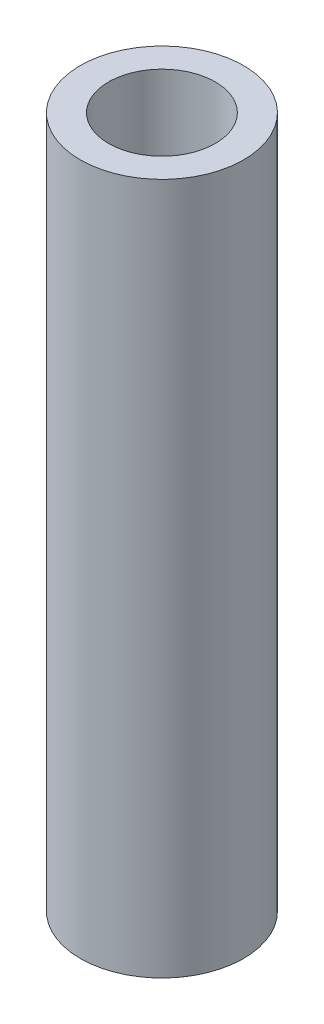
ISO-10303-21;
HEADER;
FILE_DESCRIPTION(('STEP AP214'),'2;1');
FILE_NAME('part.step','',(''),(''),'','','');
FILE_SCHEMA(('AUTOMOTIVE_DESIGN { 1 0 10303 214 1 1 1 1 }'));
ENDSEC;
DATA;
#1=APPLICATION_CONTEXT('core data for automotive mechanical design processes');
#2=APPLICATION_PROTOCOL_DEFINITION('international standard','automotive_design',2000,#1);
#3=PRODUCT_CONTEXT('',#1,'mechanical');
#4=PRODUCT('Part','Part','',(#3));
#5=PRODUCT_RELATED_PRODUCT_CATEGORY('part','',(#4));
#6=PRODUCT_DEFINITION_FORMATION('','',#4);
#7=PRODUCT_DEFINITION_CONTEXT('part definition',#1,'design');
#8=PRODUCT_DEFINITION('design','',#6,#7);
#9=PRODUCT_DEFINITION_SHAPE('','',#8);
#10=(LENGTH_UNIT() NAMED_UNIT(*) SI_UNIT(.MILLI.,.METRE.));
#11=(NAMED_UNIT(*) PLANE_ANGLE_UNIT() SI_UNIT($,.RADIAN.));
#12=(NAMED_UNIT(*) SI_UNIT($,.STERADIAN.) SOLID_ANGLE_UNIT());
#13=UNCERTAINTY_MEASURE_WITH_UNIT(LENGTH_MEASURE(1.E-05),#10,'distance_accuracy_value','');
#14=(GEOMETRIC_REPRESENTATION_CONTEXT(3) GLOBAL_UNCERTAINTY_ASSIGNED_CONTEXT((#13)) GLOBAL_UNIT_ASSIGNED_CONTEXT((#10,
#11,#12)) REPRESENTATION_CONTEXT('',''));
#15=CARTESIAN_POINT('',(0.,0.,0.));
#16=DIRECTION('',(0.,0.,1.));
#17=DIRECTION('',(1.,0.,0.));
#18=AXIS2_PLACEMENT_3D('',#15,#16,#17);
#19=CARTESIAN_POINT('',(0.,32.258,0.));
#20=DIRECTION('',(0.,1.,0.));
#21=DIRECTION('',(0.,0.,1.));
#22=AXIS2_PLACEMENT_3D('',#19,#20,#21);
#23=PLANE('',#22);
#24=CARTESIAN_POINT('',(0.,32.258,0.));
#25=DIRECTION('',(0.,1.,0.));
#26=DIRECTION('',(0.,0.,1.));
#27=AXIS2_PLACEMENT_3D('',#24,#25,#26);
#28=CIRCLE('',#27,3.81);
#29=CARTESIAN_POINT('',(0.,32.258,3.81));
#30=VERTEX_POINT('',#29);
#31=EDGE_CURVE('E10',#30,#30,#28,.T.);
#32=ORIENTED_EDGE('',*,*,#31,.T.);
#33=EDGE_LOOP('',(#32));
#34=FACE_BOUND('',#33,.T.);
#35=CARTESIAN_POINT('',(0.,32.258,0.));
#36=DIRECTION('',(0.,1.,0.));
#37=DIRECTION('',(0.,0.,1.));
#38=AXIS2_PLACEMENT_3D('',#35,#36,#37);
#39=CIRCLE('',#38,2.4892);
#40=CARTESIAN_POINT('',(0.,32.258,2.4892));
#41=VERTEX_POINT('',#40);
#42=EDGE_CURVE('E41',#41,#41,#39,.T.);
#43=ORIENTED_EDGE('',*,*,#42,.F.);
#44=EDGE_LOOP('',(#43));
#45=FACE_BOUND('',#44,.T.);
#46=ADVANCED_FACE('F30',(#34,#45),#23,.T.);
#47=CARTESIAN_POINT('',(0.,0.,0.));
#48=DIRECTION('',(0.,1.,0.));
#49=DIRECTION('',(0.,0.,1.));
#50=AXIS2_PLACEMENT_3D('',#47,#48,#49);
#51=PLANE('',#50);
#52=CARTESIAN_POINT('',(0.,0.,0.));
#53=DIRECTION('',(0.,1.,0.));
#54=DIRECTION('',(0.,0.,1.));
#55=AXIS2_PLACEMENT_3D('',#52,#53,#54);
#56=CIRCLE('',#55,3.81);
#57=CARTESIAN_POINT('',(0.,0.,3.81));
#58=VERTEX_POINT('',#57);
#59=EDGE_CURVE('E34',#58,#58,#56,.T.);
#60=ORIENTED_EDGE('',*,*,#59,.F.);
#61=EDGE_LOOP('',(#60));
#62=FACE_BOUND('',#61,.T.);
#63=CARTESIAN_POINT('',(0.,0.,0.));
#64=DIRECTION('',(0.,1.,0.));
#65=DIRECTION('',(0.,0.,1.));
#66=AXIS2_PLACEMENT_3D('',#63,#64,#65);
#67=CIRCLE('',#66,2.4892);
#68=CARTESIAN_POINT('',(0.,0.,2.4892));
#69=VERTEX_POINT('',#68);
#70=EDGE_CURVE('E43',#69,#69,#67,.T.);
#71=ORIENTED_EDGE('',*,*,#70,.T.);
#72=EDGE_LOOP('',(#71));
#73=FACE_BOUND('',#72,.T.);
#74=ADVANCED_FACE('F53',(#62,#73),#51,.F.);
#75=CARTESIAN_POINT('',(0.,32.258,0.));
#76=DIRECTION('',(0.,-1.,0.));
#77=DIRECTION('',(0.,0.,-1.));
#78=AXIS2_PLACEMENT_3D('',#75,#76,#77);
#79=CYLINDRICAL_SURFACE('',#78,3.81);
#80=ORIENTED_EDGE('',*,*,#31,.F.);
#81=EDGE_LOOP('',(#80));
#82=FACE_BOUND('',#81,.T.);
#83=ORIENTED_EDGE('',*,*,#59,.T.);
#84=EDGE_LOOP('',(#83));
#85=FACE_BOUND('',#84,.T.);
#86=ADVANCED_FACE('F32',(#82,#85),#79,.T.);
#87=CARTESIAN_POINT('',(0.,32.258,0.));
#88=DIRECTION('',(0.,-1.,0.));
#89=DIRECTION('',(0.,0.,-1.));
#90=AXIS2_PLACEMENT_3D('',#87,#88,#89);
#91=CYLINDRICAL_SURFACE('',#90,2.4892);
#92=ORIENTED_EDGE('',*,*,#42,.T.);
#93=EDGE_LOOP('',(#92));
#94=FACE_BOUND('',#93,.T.);
#95=ORIENTED_EDGE('',*,*,#70,.F.);
#96=EDGE_LOOP('',(#95));
#97=FACE_BOUND('',#96,.T.);
#98=ADVANCED_FACE('F49',(#94,#97),#91,.F.);
#99=CLOSED_SHELL('',(#46,#74,#86,#98));
#100=MANIFOLD_SOLID_BREP('B2',#99);
#101=ADVANCED_BREP_SHAPE_REPRESENTATION('',(#18,#100),#14);
#102=SHAPE_DEFINITION_REPRESENTATION(#9,#101);
ENDSEC;
END-ISO-10303-21;
